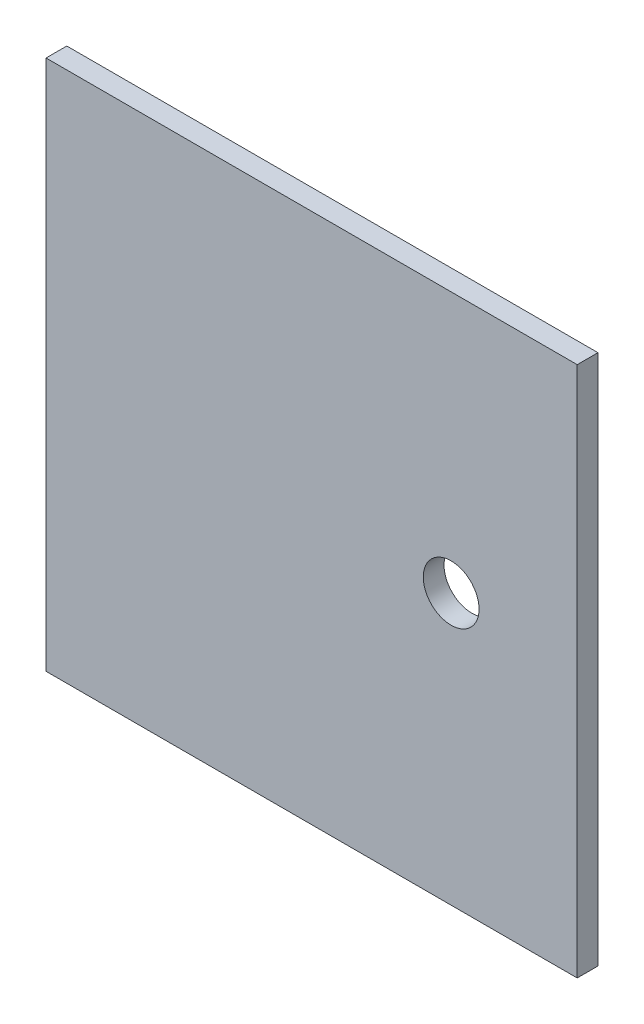
ISO-10303-21;
HEADER;
FILE_DESCRIPTION(('STEP AP214'),'2;1');
FILE_NAME('part.step','',(''),(''),'','','');
FILE_SCHEMA(('AUTOMOTIVE_DESIGN { 1 0 10303 214 1 1 1 1 }'));
ENDSEC;
DATA;
#1=APPLICATION_CONTEXT('core data for automotive mechanical design processes');
#2=APPLICATION_PROTOCOL_DEFINITION('international standard','automotive_design',2000,#1);
#3=PRODUCT_CONTEXT('',#1,'mechanical');
#4=PRODUCT('Part','Part','',(#3));
#5=PRODUCT_RELATED_PRODUCT_CATEGORY('part','',(#4));
#6=PRODUCT_DEFINITION_FORMATION('','',#4);
#7=PRODUCT_DEFINITION_CONTEXT('part definition',#1,'design');
#8=PRODUCT_DEFINITION('design','',#6,#7);
#9=PRODUCT_DEFINITION_SHAPE('','',#8);
#10=(LENGTH_UNIT() NAMED_UNIT(*) SI_UNIT(.MILLI.,.METRE.));
#11=(NAMED_UNIT(*) PLANE_ANGLE_UNIT() SI_UNIT($,.RADIAN.));
#12=(NAMED_UNIT(*) SI_UNIT($,.STERADIAN.) SOLID_ANGLE_UNIT());
#13=UNCERTAINTY_MEASURE_WITH_UNIT(LENGTH_MEASURE(1.E-05),#10,'distance_accuracy_value','');
#14=(GEOMETRIC_REPRESENTATION_CONTEXT(3) GLOBAL_UNCERTAINTY_ASSIGNED_CONTEXT((#13)) GLOBAL_UNIT_ASSIGNED_CONTEXT((#10,
#11,#12)) REPRESENTATION_CONTEXT('',''));
#15=CARTESIAN_POINT('',(0.,0.,0.));
#16=DIRECTION('',(0.,0.,1.));
#17=DIRECTION('',(1.,0.,0.));
#18=AXIS2_PLACEMENT_3D('',#15,#16,#17);
#19=CARTESIAN_POINT('',(0.,0.,3.125));
#20=DIRECTION('',(1.,0.,0.));
#21=DIRECTION('',(0.,0.,-1.));
#22=AXIS2_PLACEMENT_3D('',#19,#20,#21);
#23=PLANE('',#22);
#24=DIRECTION('',(0.,-1.,0.));
#25=VECTOR('',#24,1.);
#26=CARTESIAN_POINT('',(0.,0.,0.));
#27=LINE('',#26,#25);
#28=CARTESIAN_POINT('',(0.,80.,0.));
#29=VERTEX_POINT('',#28);
#30=CARTESIAN_POINT('',(0.,0.,0.));
#31=VERTEX_POINT('',#30);
#32=EDGE_CURVE('E107',#29,#31,#27,.T.);
#33=ORIENTED_EDGE('',*,*,#32,.T.);
#34=DIRECTION('',(0.,0.,-1.));
#35=VECTOR('',#34,1.);
#36=CARTESIAN_POINT('',(0.,0.,3.125));
#37=LINE('',#36,#35);
#38=CARTESIAN_POINT('',(0.,0.,3.125));
#39=VERTEX_POINT('',#38);
#40=EDGE_CURVE('E11',#39,#31,#37,.T.);
#41=ORIENTED_EDGE('',*,*,#40,.F.);
#42=DIRECTION('',(0.,-1.,0.));
#43=VECTOR('',#42,1.);
#44=CARTESIAN_POINT('',(0.,0.,3.125));
#45=LINE('',#44,#43);
#46=CARTESIAN_POINT('',(0.,80.,3.125));
#47=VERTEX_POINT('',#46);
#48=EDGE_CURVE('E91',#47,#39,#45,.T.);
#49=ORIENTED_EDGE('',*,*,#48,.F.);
#50=DIRECTION('',(0.,0.,-1.));
#51=VECTOR('',#50,1.);
#52=CARTESIAN_POINT('',(0.,80.,3.125));
#53=LINE('',#52,#51);
#54=EDGE_CURVE('E103',#47,#29,#53,.T.);
#55=ORIENTED_EDGE('',*,*,#54,.T.);
#56=EDGE_LOOP('',(#33,#41,#49,#55));
#57=FACE_BOUND('',#56,.T.);
#58=ADVANCED_FACE('F39',(#57),#23,.F.);
#59=CARTESIAN_POINT('',(0.,0.,3.125));
#60=DIRECTION('',(0.,1.,0.));
#61=DIRECTION('',(0.,0.,1.));
#62=AXIS2_PLACEMENT_3D('',#59,#60,#61);
#63=PLANE('',#62);
#64=DIRECTION('',(1.,0.,0.));
#65=VECTOR('',#64,1.);
#66=CARTESIAN_POINT('',(0.,0.,0.));
#67=LINE('',#66,#65);
#68=CARTESIAN_POINT('',(80.,0.,0.));
#69=VERTEX_POINT('',#68);
#70=EDGE_CURVE('E96',#31,#69,#67,.T.);
#71=ORIENTED_EDGE('',*,*,#70,.T.);
#72=DIRECTION('',(0.,0.,-1.));
#73=VECTOR('',#72,1.);
#74=CARTESIAN_POINT('',(80.,0.,3.125));
#75=LINE('',#74,#73);
#76=CARTESIAN_POINT('',(80.,0.,3.125));
#77=VERTEX_POINT('',#76);
#78=EDGE_CURVE('E48',#77,#69,#75,.T.);
#79=ORIENTED_EDGE('',*,*,#78,.F.);
#80=DIRECTION('',(1.,0.,0.));
#81=VECTOR('',#80,1.);
#82=CARTESIAN_POINT('',(0.,0.,3.125));
#83=LINE('',#82,#81);
#84=EDGE_CURVE('E86',#39,#77,#83,.T.);
#85=ORIENTED_EDGE('',*,*,#84,.F.);
#86=ORIENTED_EDGE('',*,*,#40,.T.);
#87=EDGE_LOOP('',(#71,#79,#85,#86));
#88=FACE_BOUND('',#87,.T.);
#89=ADVANCED_FACE('F95',(#88),#63,.F.);
#90=CARTESIAN_POINT('',(80.,0.,3.125));
#91=DIRECTION('',(-1.,0.,0.));
#92=DIRECTION('',(0.,0.,1.));
#93=AXIS2_PLACEMENT_3D('',#90,#91,#92);
#94=PLANE('',#93);
#95=DIRECTION('',(0.,1.,0.));
#96=VECTOR('',#95,1.);
#97=CARTESIAN_POINT('',(80.,0.,0.));
#98=LINE('',#97,#96);
#99=CARTESIAN_POINT('',(80.,80.,0.));
#100=VERTEX_POINT('',#99);
#101=EDGE_CURVE('E73',#69,#100,#98,.T.);
#102=ORIENTED_EDGE('',*,*,#101,.T.);
#103=DIRECTION('',(0.,0.,-1.));
#104=VECTOR('',#103,1.);
#105=CARTESIAN_POINT('',(80.,80.,3.125));
#106=LINE('',#105,#104);
#107=CARTESIAN_POINT('',(80.,80.,3.125));
#108=VERTEX_POINT('',#107);
#109=EDGE_CURVE('E98',#108,#100,#106,.T.);
#110=ORIENTED_EDGE('',*,*,#109,.F.);
#111=DIRECTION('',(0.,1.,0.));
#112=VECTOR('',#111,1.);
#113=CARTESIAN_POINT('',(80.,0.,3.125));
#114=LINE('',#113,#112);
#115=EDGE_CURVE('E89',#77,#108,#114,.T.);
#116=ORIENTED_EDGE('',*,*,#115,.F.);
#117=ORIENTED_EDGE('',*,*,#78,.T.);
#118=EDGE_LOOP('',(#102,#110,#116,#117));
#119=FACE_BOUND('',#118,.T.);
#120=ADVANCED_FACE('F99',(#119),#94,.F.);
#121=CARTESIAN_POINT('',(0.,80.,3.125));
#122=DIRECTION('',(0.,-1.,0.));
#123=DIRECTION('',(0.,0.,-1.));
#124=AXIS2_PLACEMENT_3D('',#121,#122,#123);
#125=PLANE('',#124);
#126=DIRECTION('',(-1.,0.,0.));
#127=VECTOR('',#126,1.);
#128=CARTESIAN_POINT('',(0.,80.,0.));
#129=LINE('',#128,#127);
#130=EDGE_CURVE('E79',#100,#29,#129,.T.);
#131=ORIENTED_EDGE('',*,*,#130,.T.);
#132=ORIENTED_EDGE('',*,*,#54,.F.);
#133=DIRECTION('',(-1.,0.,0.));
#134=VECTOR('',#133,1.);
#135=CARTESIAN_POINT('',(0.,80.,3.125));
#136=LINE('',#135,#134);
#137=EDGE_CURVE('E56',#108,#47,#136,.T.);
#138=ORIENTED_EDGE('',*,*,#137,.F.);
#139=ORIENTED_EDGE('',*,*,#109,.T.);
#140=EDGE_LOOP('',(#131,#132,#138,#139));
#141=FACE_BOUND('',#140,.T.);
#142=ADVANCED_FACE('F121',(#141),#125,.F.);
#143=CARTESIAN_POINT('',(0.,0.,3.125));
#144=DIRECTION('',(0.,0.,-1.));
#145=DIRECTION('',(-1.,0.,0.));
#146=AXIS2_PLACEMENT_3D('',#143,#144,#145);
#147=PLANE('',#146);
#148=CARTESIAN_POINT('',(61.0147426826504,40.7151614001949,3.125));
#149=DIRECTION('',(0.,0.,1.));
#150=DIRECTION('',(1.,0.,0.));
#151=AXIS2_PLACEMENT_3D('',#148,#149,#150);
#152=CIRCLE('',#151,4.2);
#153=CARTESIAN_POINT('',(65.2147426826503,40.7151614001949,3.125));
#154=VERTEX_POINT('',#153);
#155=EDGE_CURVE('E128',#154,#154,#152,.T.);
#156=ORIENTED_EDGE('',*,*,#155,.F.);
#157=EDGE_LOOP('',(#156));
#158=FACE_BOUND('',#157,.T.);
#159=ORIENTED_EDGE('',*,*,#48,.T.);
#160=ORIENTED_EDGE('',*,*,#84,.T.);
#161=ORIENTED_EDGE('',*,*,#115,.T.);
#162=ORIENTED_EDGE('',*,*,#137,.T.);
#163=EDGE_LOOP('',(#159,#160,#161,#162));
#164=FACE_BOUND('',#163,.T.);
#165=ADVANCED_FACE('F87',(#158,#164),#147,.F.);
#166=CARTESIAN_POINT('',(0.,0.,0.));
#167=DIRECTION('',(0.,0.,-1.));
#168=DIRECTION('',(-1.,0.,0.));
#169=AXIS2_PLACEMENT_3D('',#166,#167,#168);
#170=PLANE('',#169);
#171=CARTESIAN_POINT('',(61.0147426826504,40.7151614001949,0.));
#172=DIRECTION('',(0.,0.,1.));
#173=DIRECTION('',(1.,0.,0.));
#174=AXIS2_PLACEMENT_3D('',#171,#172,#173);
#175=CIRCLE('',#174,4.2);
#176=CARTESIAN_POINT('',(65.2147426826503,40.7151614001949,0.));
#177=VERTEX_POINT('',#176);
#178=EDGE_CURVE('E111',#177,#177,#175,.T.);
#179=ORIENTED_EDGE('',*,*,#178,.T.);
#180=EDGE_LOOP('',(#179));
#181=FACE_BOUND('',#180,.T.);
#182=ORIENTED_EDGE('',*,*,#32,.F.);
#183=ORIENTED_EDGE('',*,*,#130,.F.);
#184=ORIENTED_EDGE('',*,*,#101,.F.);
#185=ORIENTED_EDGE('',*,*,#70,.F.);
#186=EDGE_LOOP('',(#182,#183,#184,#185));
#187=FACE_BOUND('',#186,.T.);
#188=ADVANCED_FACE('F124',(#181,#187),#170,.T.);
#189=CARTESIAN_POINT('',(61.0147426826504,40.7151614001949,0.));
#190=DIRECTION('',(0.,0.,1.));
#191=DIRECTION('',(1.,0.,0.));
#192=AXIS2_PLACEMENT_3D('',#189,#190,#191);
#193=CYLINDRICAL_SURFACE('',#192,4.2);
#194=ORIENTED_EDGE('',*,*,#178,.F.);
#195=EDGE_LOOP('',(#194));
#196=FACE_BOUND('',#195,.T.);
#197=ORIENTED_EDGE('',*,*,#155,.T.);
#198=EDGE_LOOP('',(#197));
#199=FACE_BOUND('',#198,.T.);
#200=ADVANCED_FACE('F137',(#196,#199),#193,.F.);
#201=CLOSED_SHELL('',(#58,#89,#120,#142,#165,#188,#200));
#202=MANIFOLD_SOLID_BREP('B2',#201);
#203=ADVANCED_BREP_SHAPE_REPRESENTATION('',(#18,#202),#14);
#204=SHAPE_DEFINITION_REPRESENTATION(#9,#203);
ENDSEC;
END-ISO-10303-21;
